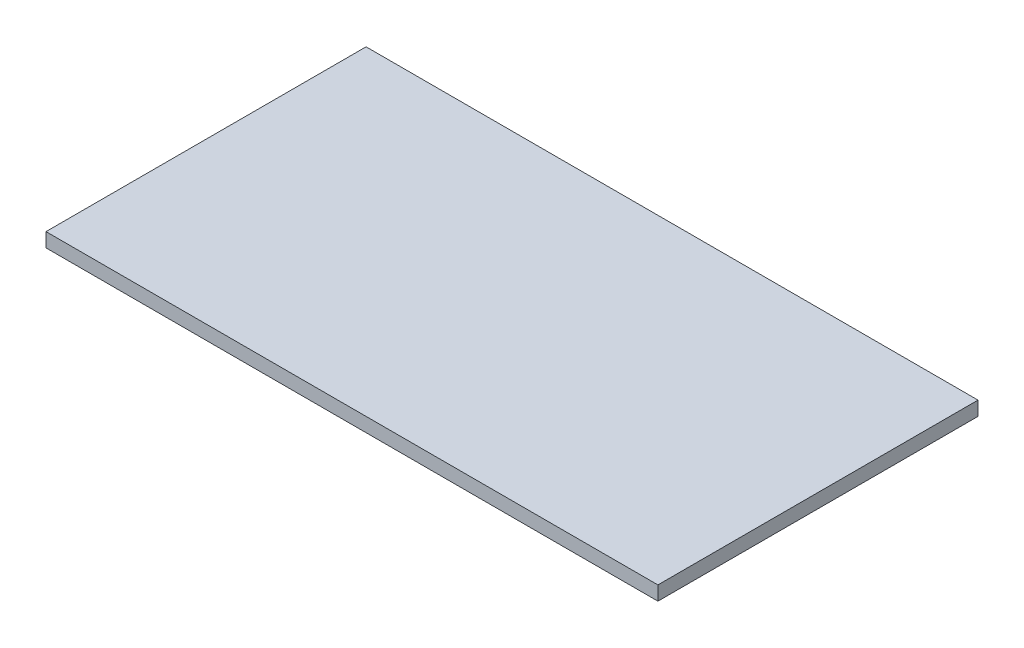
ISO-10303-21;
HEADER;
FILE_DESCRIPTION(('STEP AP214'),'2;1');
FILE_NAME('part.step','',(''),(''),'','','');
FILE_SCHEMA(('AUTOMOTIVE_DESIGN { 1 0 10303 214 1 1 1 1 }'));
ENDSEC;
DATA;
#1=APPLICATION_CONTEXT('core data for automotive mechanical design processes');
#2=APPLICATION_PROTOCOL_DEFINITION('international standard','automotive_design',2000,#1);
#3=PRODUCT_CONTEXT('',#1,'mechanical');
#4=PRODUCT('Part','Part','',(#3));
#5=PRODUCT_RELATED_PRODUCT_CATEGORY('part','',(#4));
#6=PRODUCT_DEFINITION_FORMATION('','',#4);
#7=PRODUCT_DEFINITION_CONTEXT('part definition',#1,'design');
#8=PRODUCT_DEFINITION('design','',#6,#7);
#9=PRODUCT_DEFINITION_SHAPE('','',#8);
#10=(LENGTH_UNIT() NAMED_UNIT(*) SI_UNIT(.MILLI.,.METRE.));
#11=(NAMED_UNIT(*) PLANE_ANGLE_UNIT() SI_UNIT($,.RADIAN.));
#12=(NAMED_UNIT(*) SI_UNIT($,.STERADIAN.) SOLID_ANGLE_UNIT());
#13=UNCERTAINTY_MEASURE_WITH_UNIT(LENGTH_MEASURE(1.E-05),#10,'distance_accuracy_value','');
#14=(GEOMETRIC_REPRESENTATION_CONTEXT(3) GLOBAL_UNCERTAINTY_ASSIGNED_CONTEXT((#13)) GLOBAL_UNIT_ASSIGNED_CONTEXT((#10,
#11,#12)) REPRESENTATION_CONTEXT('',''));
#15=CARTESIAN_POINT('',(0.,0.,0.));
#16=DIRECTION('',(0.,0.,1.));
#17=DIRECTION('',(1.,0.,0.));
#18=AXIS2_PLACEMENT_3D('',#15,#16,#17);
#19=CARTESIAN_POINT('',(-16.3867976370598,3.,18.622747088304));
#20=DIRECTION('',(1.,0.,0.));
#21=DIRECTION('',(0.,0.,-1.));
#22=AXIS2_PLACEMENT_3D('',#19,#20,#21);
#23=PLANE('',#22);
#24=DIRECTION('',(0.,0.,1.));
#25=VECTOR('',#24,1.);
#26=CARTESIAN_POINT('',(-16.3867976370598,0.,18.622747088304));
#27=LINE('',#26,#25);
#28=CARTESIAN_POINT('',(-16.3867976370598,0.,-49.377252911696));
#29=VERTEX_POINT('',#28);
#30=CARTESIAN_POINT('',(-16.3867976370598,0.,18.622747088304));
#31=VERTEX_POINT('',#30);
#32=EDGE_CURVE('E96',#29,#31,#27,.T.);
#33=ORIENTED_EDGE('',*,*,#32,.T.);
#34=DIRECTION('',(0.,-1.,0.));
#35=VECTOR('',#34,1.);
#36=CARTESIAN_POINT('',(-16.3867976370598,3.,18.622747088304));
#37=LINE('',#36,#35);
#38=CARTESIAN_POINT('',(-16.3867976370598,3.,18.622747088304));
#39=VERTEX_POINT('',#38);
#40=EDGE_CURVE('E11',#39,#31,#37,.T.);
#41=ORIENTED_EDGE('',*,*,#40,.F.);
#42=DIRECTION('',(0.,0.,1.));
#43=VECTOR('',#42,1.);
#44=CARTESIAN_POINT('',(-16.3867976370598,3.,18.622747088304));
#45=LINE('',#44,#43);
#46=CARTESIAN_POINT('',(-16.3867976370598,3.,-49.377252911696));
#47=VERTEX_POINT('',#46);
#48=EDGE_CURVE('E84',#47,#39,#45,.T.);
#49=ORIENTED_EDGE('',*,*,#48,.F.);
#50=DIRECTION('',(0.,-1.,0.));
#51=VECTOR('',#50,1.);
#52=CARTESIAN_POINT('',(-16.3867976370598,3.,-49.377252911696));
#53=LINE('',#52,#51);
#54=EDGE_CURVE('E92',#47,#29,#53,.T.);
#55=ORIENTED_EDGE('',*,*,#54,.T.);
#56=EDGE_LOOP('',(#33,#41,#49,#55));
#57=FACE_BOUND('',#56,.T.);
#58=ADVANCED_FACE('F33',(#57),#23,.F.);
#59=CARTESIAN_POINT('',(-16.3867976370598,3.,18.622747088304));
#60=DIRECTION('',(0.,0.,-1.));
#61=DIRECTION('',(-1.,0.,0.));
#62=AXIS2_PLACEMENT_3D('',#59,#60,#61);
#63=PLANE('',#62);
#64=DIRECTION('',(1.,0.,0.));
#65=VECTOR('',#64,1.);
#66=CARTESIAN_POINT('',(-16.3867976370598,0.,18.622747088304));
#67=LINE('',#66,#65);
#68=CARTESIAN_POINT('',(113.61320236294,0.,18.622747088304));
#69=VERTEX_POINT('',#68);
#70=EDGE_CURVE('E88',#31,#69,#67,.T.);
#71=ORIENTED_EDGE('',*,*,#70,.T.);
#72=DIRECTION('',(0.,-1.,0.));
#73=VECTOR('',#72,1.);
#74=CARTESIAN_POINT('',(113.61320236294,3.,18.622747088304));
#75=LINE('',#74,#73);
#76=CARTESIAN_POINT('',(113.61320236294,3.,18.622747088304));
#77=VERTEX_POINT('',#76);
#78=EDGE_CURVE('E41',#77,#69,#75,.T.);
#79=ORIENTED_EDGE('',*,*,#78,.F.);
#80=DIRECTION('',(1.,0.,0.));
#81=VECTOR('',#80,1.);
#82=CARTESIAN_POINT('',(-16.3867976370598,3.,18.622747088304));
#83=LINE('',#82,#81);
#84=EDGE_CURVE('E79',#39,#77,#83,.T.);
#85=ORIENTED_EDGE('',*,*,#84,.F.);
#86=ORIENTED_EDGE('',*,*,#40,.T.);
#87=EDGE_LOOP('',(#71,#79,#85,#86));
#88=FACE_BOUND('',#87,.T.);
#89=ADVANCED_FACE('F87',(#88),#63,.F.);
#90=CARTESIAN_POINT('',(113.61320236294,3.,18.622747088304));
#91=DIRECTION('',(-1.,0.,0.));
#92=DIRECTION('',(0.,0.,1.));
#93=AXIS2_PLACEMENT_3D('',#90,#91,#92);
#94=PLANE('',#93);
#95=DIRECTION('',(0.,0.,-1.));
#96=VECTOR('',#95,1.);
#97=CARTESIAN_POINT('',(113.61320236294,0.,18.622747088304));
#98=LINE('',#97,#96);
#99=CARTESIAN_POINT('',(113.61320236294,0.,-49.377252911696));
#100=VERTEX_POINT('',#99);
#101=EDGE_CURVE('E66',#69,#100,#98,.T.);
#102=ORIENTED_EDGE('',*,*,#101,.T.);
#103=DIRECTION('',(0.,-1.,0.));
#104=VECTOR('',#103,1.);
#105=CARTESIAN_POINT('',(113.61320236294,3.,-49.377252911696));
#106=LINE('',#105,#104);
#107=CARTESIAN_POINT('',(113.61320236294,3.,-49.377252911696));
#108=VERTEX_POINT('',#107);
#109=EDGE_CURVE('E89',#108,#100,#106,.T.);
#110=ORIENTED_EDGE('',*,*,#109,.F.);
#111=DIRECTION('',(0.,0.,-1.));
#112=VECTOR('',#111,1.);
#113=CARTESIAN_POINT('',(113.61320236294,3.,18.622747088304));
#114=LINE('',#113,#112);
#115=EDGE_CURVE('E82',#77,#108,#114,.T.);
#116=ORIENTED_EDGE('',*,*,#115,.F.);
#117=ORIENTED_EDGE('',*,*,#78,.T.);
#118=EDGE_LOOP('',(#102,#110,#116,#117));
#119=FACE_BOUND('',#118,.T.);
#120=ADVANCED_FACE('F90',(#119),#94,.F.);
#121=CARTESIAN_POINT('',(-16.3867976370598,3.,-49.377252911696));
#122=DIRECTION('',(0.,0.,1.));
#123=DIRECTION('',(1.,0.,0.));
#124=AXIS2_PLACEMENT_3D('',#121,#122,#123);
#125=PLANE('',#124);
#126=DIRECTION('',(-1.,0.,0.));
#127=VECTOR('',#126,1.);
#128=CARTESIAN_POINT('',(-16.3867976370598,0.,-49.377252911696));
#129=LINE('',#128,#127);
#130=EDGE_CURVE('E72',#100,#29,#129,.T.);
#131=ORIENTED_EDGE('',*,*,#130,.T.);
#132=ORIENTED_EDGE('',*,*,#54,.F.);
#133=DIRECTION('',(-1.,0.,0.));
#134=VECTOR('',#133,1.);
#135=CARTESIAN_POINT('',(-16.3867976370598,3.,-49.377252911696));
#136=LINE('',#135,#134);
#137=EDGE_CURVE('E49',#108,#47,#136,.T.);
#138=ORIENTED_EDGE('',*,*,#137,.F.);
#139=ORIENTED_EDGE('',*,*,#109,.T.);
#140=EDGE_LOOP('',(#131,#132,#138,#139));
#141=FACE_BOUND('',#140,.T.);
#142=ADVANCED_FACE('F103',(#141),#125,.F.);
#143=CARTESIAN_POINT('',(0.,3.,0.));
#144=DIRECTION('',(0.,-1.,0.));
#145=DIRECTION('',(0.,0.,-1.));
#146=AXIS2_PLACEMENT_3D('',#143,#144,#145);
#147=PLANE('',#146);
#148=ORIENTED_EDGE('',*,*,#48,.T.);
#149=ORIENTED_EDGE('',*,*,#84,.T.);
#150=ORIENTED_EDGE('',*,*,#115,.T.);
#151=ORIENTED_EDGE('',*,*,#137,.T.);
#152=EDGE_LOOP('',(#148,#149,#150,#151));
#153=FACE_BOUND('',#152,.T.);
#154=ADVANCED_FACE('F80',(#153),#147,.F.);
#155=CARTESIAN_POINT('',(0.,0.,0.));
#156=DIRECTION('',(0.,-1.,0.));
#157=DIRECTION('',(0.,0.,-1.));
#158=AXIS2_PLACEMENT_3D('',#155,#156,#157);
#159=PLANE('',#158);
#160=ORIENTED_EDGE('',*,*,#32,.F.);
#161=ORIENTED_EDGE('',*,*,#130,.F.);
#162=ORIENTED_EDGE('',*,*,#101,.F.);
#163=ORIENTED_EDGE('',*,*,#70,.F.);
#164=EDGE_LOOP('',(#160,#161,#162,#163));
#165=FACE_BOUND('',#164,.T.);
#166=ADVANCED_FACE('F106',(#165),#159,.T.);
#167=CLOSED_SHELL('',(#58,#89,#120,#142,#154,#166));
#168=MANIFOLD_SOLID_BREP('B2',#167);
#169=ADVANCED_BREP_SHAPE_REPRESENTATION('',(#18,#168),#14);
#170=SHAPE_DEFINITION_REPRESENTATION(#9,#169);
ENDSEC;
END-ISO-10303-21;
